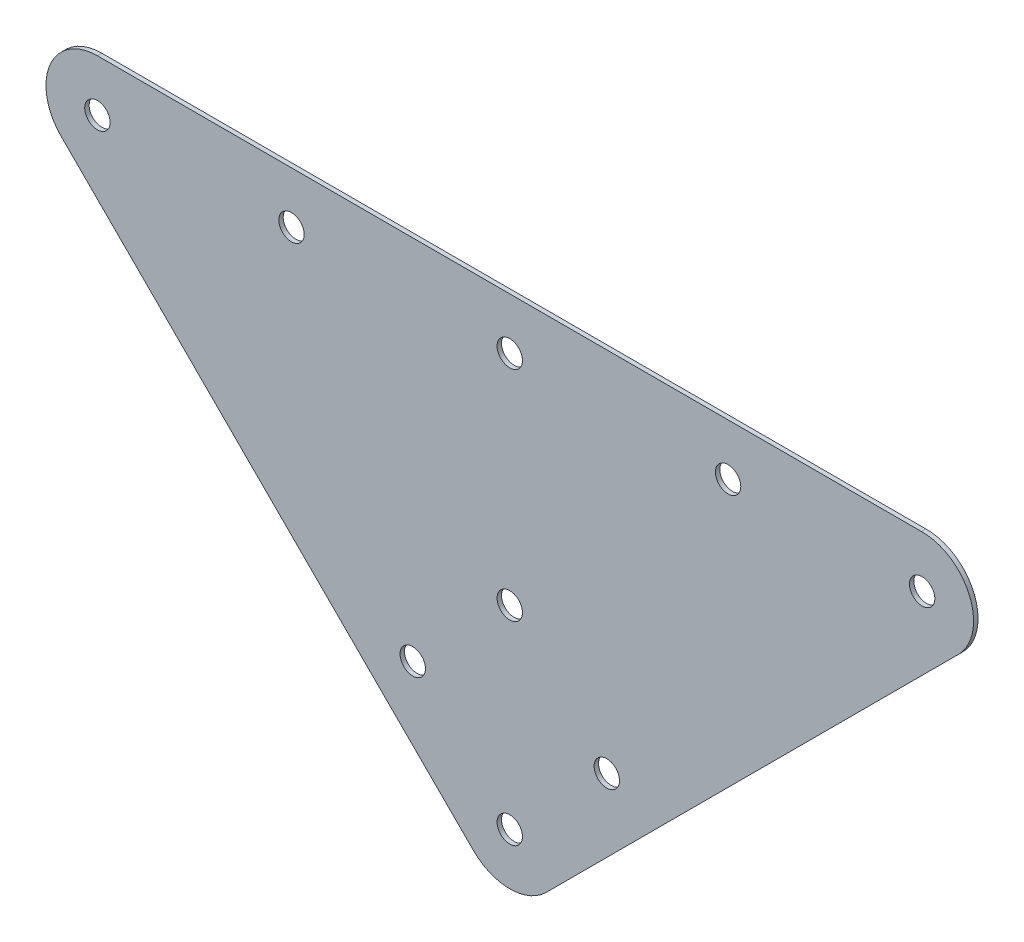
ISO-10303-21;
HEADER;
FILE_DESCRIPTION(('STEP AP214'),'2;1');
FILE_NAME('part.step','',(''),(''),'','','');
FILE_SCHEMA(('AUTOMOTIVE_DESIGN { 1 0 10303 214 1 1 1 1 }'));
ENDSEC;
DATA;
#1=APPLICATION_CONTEXT('core data for automotive mechanical design processes');
#2=APPLICATION_PROTOCOL_DEFINITION('international standard','automotive_design',2000,#1);
#3=PRODUCT_CONTEXT('',#1,'mechanical');
#4=PRODUCT('Part','Part','',(#3));
#5=PRODUCT_RELATED_PRODUCT_CATEGORY('part','',(#4));
#6=PRODUCT_DEFINITION_FORMATION('','',#4);
#7=PRODUCT_DEFINITION_CONTEXT('part definition',#1,'design');
#8=PRODUCT_DEFINITION('design','',#6,#7);
#9=PRODUCT_DEFINITION_SHAPE('','',#8);
#10=(LENGTH_UNIT() NAMED_UNIT(*) SI_UNIT(.MILLI.,.METRE.));
#11=(NAMED_UNIT(*) PLANE_ANGLE_UNIT() SI_UNIT($,.RADIAN.));
#12=(NAMED_UNIT(*) SI_UNIT($,.STERADIAN.) SOLID_ANGLE_UNIT());
#13=UNCERTAINTY_MEASURE_WITH_UNIT(LENGTH_MEASURE(1.E-05),#10,'distance_accuracy_value','');
#14=(GEOMETRIC_REPRESENTATION_CONTEXT(3) GLOBAL_UNCERTAINTY_ASSIGNED_CONTEXT((#13)) GLOBAL_UNIT_ASSIGNED_CONTEXT((#10,
#11,#12)) REPRESENTATION_CONTEXT('',''));
#15=CARTESIAN_POINT('',(0.,0.,0.));
#16=DIRECTION('',(0.,0.,1.));
#17=DIRECTION('',(1.,0.,0.));
#18=AXIS2_PLACEMENT_3D('',#15,#16,#17);
#19=CARTESIAN_POINT('',(-198.65512242099,-171.71435405727,1.6417931858));
#20=DIRECTION('',(0.,0.,1.));
#21=DIRECTION('',(1.,0.,0.));
#22=AXIS2_PLACEMENT_3D('',#19,#20,#21);
#23=PLANE('',#22);
#24=CARTESIAN_POINT('',(-198.65512242099,-99.8723050887162,1.6417931858));
#25=DIRECTION('',(0.,0.,1.));
#26=DIRECTION('',(1.,0.,0.));
#27=AXIS2_PLACEMENT_3D('',#24,#25,#26);
#28=CIRCLE('',#27,4.699);
#29=CARTESIAN_POINT('',(-193.95612242099,-99.8723050887162,1.6417931858));
#30=VERTEX_POINT('',#29);
#31=EDGE_CURVE('E402',#30,#30,#28,.T.);
#32=ORIENTED_EDGE('',*,*,#31,.F.);
#33=EDGE_LOOP('',(#32));
#34=FACE_BOUND('',#33,.T.);
#35=CARTESIAN_POINT('',(-198.65512242099,-171.71435405727,1.6417931858));
#36=DIRECTION('',(0.,0.,1.));
#37=DIRECTION('',(1.,0.,0.));
#38=AXIS2_PLACEMENT_3D('',#35,#36,#37);
#39=CIRCLE('',#38,4.699);
#40=CARTESIAN_POINT('',(-193.95612242099,-171.71435405727,1.6417931858));
#41=VERTEX_POINT('',#40);
#42=EDGE_CURVE('E414',#41,#41,#39,.T.);
#43=ORIENTED_EDGE('',*,*,#42,.F.);
#44=EDGE_LOOP('',(#43));
#45=FACE_BOUND('',#44,.T.);
#46=CARTESIAN_POINT('',(-279.47742751088,-19.05,1.6417931858));
#47=DIRECTION('',(0.,0.,1.));
#48=DIRECTION('',(1.,0.,0.));
#49=AXIS2_PLACEMENT_3D('',#46,#47,#48);
#50=CIRCLE('',#49,4.69900000000003);
#51=CARTESIAN_POINT('',(-274.77842751088,-19.05,1.6417931858));
#52=VERTEX_POINT('',#51);
#53=EDGE_CURVE('E426',#52,#52,#50,.T.);
#54=ORIENTED_EDGE('',*,*,#53,.F.);
#55=EDGE_LOOP('',(#54));
#56=FACE_BOUND('',#55,.T.);
#57=CARTESIAN_POINT('',(-117.83281721299,-19.05,1.6417931858));
#58=DIRECTION('',(0.,0.,1.));
#59=DIRECTION('',(1.,0.,0.));
#60=AXIS2_PLACEMENT_3D('',#57,#58,#59);
#61=CIRCLE('',#60,4.69899999999999);
#62=CARTESIAN_POINT('',(-113.13381721299,-19.05,1.6417931858));
#63=VERTEX_POINT('',#62);
#64=EDGE_CURVE('E438',#63,#63,#61,.T.);
#65=ORIENTED_EDGE('',*,*,#64,.F.);
#66=EDGE_LOOP('',(#65));
#67=FACE_BOUND('',#66,.T.);
#68=CARTESIAN_POINT('',(-198.65512242099,-171.71435405727,1.6417931858));
#69=DIRECTION('',(0.,0.,1.));
#70=DIRECTION('',(1.,0.,0.));
#71=AXIS2_PLACEMENT_3D('',#68,#69,#70);
#72=CIRCLE('',#71,19.0500000003624);
#73=CARTESIAN_POINT('',(-212.12550660285,-185.18473823913,1.6417931858));
#74=VERTEX_POINT('',#73);
#75=CARTESIAN_POINT('',(-185.18473823913,-185.18473823913,1.6417931858));
#76=VERTEX_POINT('',#75);
#77=EDGE_CURVE('E325',#74,#76,#72,.T.);
#78=ORIENTED_EDGE('',*,*,#77,.T.);
#79=DIRECTION('',(0.707106781186548,0.707106781186547,0.));
#80=VECTOR('',#79,1.);
#81=CARTESIAN_POINT('',(-185.18473823913,-185.18473823913,1.6417931858));
#82=LINE('',#81,#80);
#83=CARTESIAN_POINT('',(-32.7175007528533,-32.7175007528533,1.6417931858));
#84=VERTEX_POINT('',#83);
#85=EDGE_CURVE('E274',#76,#84,#82,.T.);
#86=ORIENTED_EDGE('',*,*,#85,.T.);
#87=CARTESIAN_POINT('',(-45.99076836499,-19.05,1.6417931858));
#88=DIRECTION('',(0.,0.,-1.));
#89=DIRECTION('',(-1.,0.,0.));
#90=AXIS2_PLACEMENT_3D('',#87,#88,#89);
#91=CIRCLE('',#90,19.0520395216009);
#92=CARTESIAN_POINT('',(-46.2695333782919,0.,1.6417931858));
#93=VERTEX_POINT('',#92);
#94=EDGE_CURVE('E292',#93,#84,#91,.T.);
#95=ORIENTED_EDGE('',*,*,#94,.F.);
#96=DIRECTION('',(-1.,0.,0.));
#97=VECTOR('',#96,1.);
#98=CARTESIAN_POINT('',(-46.2695333782919,0.,1.6417931858));
#99=LINE('',#98,#97);
#100=CARTESIAN_POINT('',(-351.31947646048,0.,1.6417931858));
#101=VERTEX_POINT('',#100);
#102=EDGE_CURVE('E285',#93,#101,#99,.T.);
#103=ORIENTED_EDGE('',*,*,#102,.T.);
#104=CARTESIAN_POINT('',(-351.319476478773,-19.05,1.6417931858));
#105=DIRECTION('',(0.,0.,-1.));
#106=DIRECTION('',(-1.,0.,0.));
#107=AXIS2_PLACEMENT_3D('',#104,#105,#106);
#108=CIRCLE('',#107,19.05);
#109=CARTESIAN_POINT('',(-364.78986065123,-32.5203841907501,1.6417931858));
#110=VERTEX_POINT('',#109);
#111=EDGE_CURVE('E290',#110,#101,#108,.T.);
#112=ORIENTED_EDGE('',*,*,#111,.F.);
#113=DIRECTION('',(-0.707106781186548,0.707106781186547,0.));
#114=VECTOR('',#113,1.);
#115=CARTESIAN_POINT('',(-212.12550660285,-185.18473823913,1.6417931858));
#116=LINE('',#115,#114);
#117=EDGE_CURVE('E305',#74,#110,#116,.T.);
#118=ORIENTED_EDGE('',*,*,#117,.F.);
#119=EDGE_LOOP('',(#78,#86,#95,#103,#112,#118));
#120=FACE_BOUND('',#119,.T.);
#121=CARTESIAN_POINT('',(-45.99076836499,-19.05,1.6417931858));
#122=DIRECTION('',(0.,0.,1.));
#123=DIRECTION('',(1.,0.,0.));
#124=AXIS2_PLACEMENT_3D('',#121,#122,#123);
#125=CIRCLE('',#124,4.699);
#126=CARTESIAN_POINT('',(-41.29176836499,-19.05,1.6417931858));
#127=VERTEX_POINT('',#126);
#128=EDGE_CURVE('E313',#127,#127,#125,.T.);
#129=ORIENTED_EDGE('',*,*,#128,.F.);
#130=EDGE_LOOP('',(#129));
#131=FACE_BOUND('',#130,.T.);
#132=CARTESIAN_POINT('',(-198.65512242099,-19.05,1.6417931858));
#133=DIRECTION('',(0.,0.,1.));
#134=DIRECTION('',(1.,0.,0.));
#135=AXIS2_PLACEMENT_3D('',#132,#133,#134);
#136=CIRCLE('',#135,4.699);
#137=CARTESIAN_POINT('',(-193.95612242099,-19.05,1.6417931858));
#138=VERTEX_POINT('',#137);
#139=EDGE_CURVE('E432',#138,#138,#136,.T.);
#140=ORIENTED_EDGE('',*,*,#139,.F.);
#141=EDGE_LOOP('',(#140));
#142=FACE_BOUND('',#141,.T.);
#143=CARTESIAN_POINT('',(-162.734097936713,-135.793329572993,1.6417931858));
#144=DIRECTION('',(0.,0.,1.));
#145=DIRECTION('',(1.,0.,0.));
#146=AXIS2_PLACEMENT_3D('',#143,#144,#145);
#147=CIRCLE('',#146,4.699);
#148=CARTESIAN_POINT('',(-158.035097936713,-135.793329572993,1.6417931858));
#149=VERTEX_POINT('',#148);
#150=EDGE_CURVE('E420',#149,#149,#147,.T.);
#151=ORIENTED_EDGE('',*,*,#150,.F.);
#152=EDGE_LOOP('',(#151));
#153=FACE_BOUND('',#152,.T.);
#154=CARTESIAN_POINT('',(-234.576146905524,-135.79332957325,1.6417931858));
#155=DIRECTION('',(0.,0.,1.));
#156=DIRECTION('',(1.,0.,0.));
#157=AXIS2_PLACEMENT_3D('',#154,#155,#156);
#158=CIRCLE('',#157,4.69900000000024);
#159=CARTESIAN_POINT('',(-229.877146905524,-135.79332957325,1.6417931858));
#160=VERTEX_POINT('',#159);
#161=EDGE_CURVE('E408',#160,#160,#158,.T.);
#162=ORIENTED_EDGE('',*,*,#161,.F.);
#163=EDGE_LOOP('',(#162));
#164=FACE_BOUND('',#163,.T.);
#165=CARTESIAN_POINT('',(-351.319476478773,-19.05,1.6417931858));
#166=DIRECTION('',(0.,0.,1.));
#167=DIRECTION('',(1.,0.,0.));
#168=AXIS2_PLACEMENT_3D('',#165,#166,#167);
#169=CIRCLE('',#168,4.69900000000009);
#170=CARTESIAN_POINT('',(-346.620476478773,-19.05,1.6417931858));
#171=VERTEX_POINT('',#170);
#172=EDGE_CURVE('E393',#171,#171,#169,.T.);
#173=ORIENTED_EDGE('',*,*,#172,.F.);
#174=EDGE_LOOP('',(#173));
#175=FACE_BOUND('',#174,.T.);
#176=ADVANCED_FACE('F225',(#34,#45,#56,#67,#120,#131,#142,#153,#164,#175),#23,.T.);
#177=CARTESIAN_POINT('',(-198.65512242099,-171.71435405727,0.));
#178=DIRECTION('',(0.,0.,1.));
#179=DIRECTION('',(1.,0.,0.));
#180=AXIS2_PLACEMENT_3D('',#177,#178,#179);
#181=PLANE('',#180);
#182=CARTESIAN_POINT('',(-198.65512242099,-171.71435405727,0.));
#183=DIRECTION('',(0.,0.,1.));
#184=DIRECTION('',(1.,0.,0.));
#185=AXIS2_PLACEMENT_3D('',#182,#183,#184);
#186=CIRCLE('',#185,19.0500000003624);
#187=CARTESIAN_POINT('',(-212.12550660285,-185.18473823913,0.));
#188=VERTEX_POINT('',#187);
#189=CARTESIAN_POINT('',(-185.18473823913,-185.18473823913,0.));
#190=VERTEX_POINT('',#189);
#191=EDGE_CURVE('E310',#188,#190,#186,.T.);
#192=ORIENTED_EDGE('',*,*,#191,.F.);
#193=DIRECTION('',(-0.707106781186548,0.707106781186547,0.));
#194=VECTOR('',#193,1.);
#195=CARTESIAN_POINT('',(-212.12550660285,-185.18473823913,0.));
#196=LINE('',#195,#194);
#197=CARTESIAN_POINT('',(-364.78986065123,-32.5203841907501,0.));
#198=VERTEX_POINT('',#197);
#199=EDGE_CURVE('E322',#188,#198,#196,.T.);
#200=ORIENTED_EDGE('',*,*,#199,.T.);
#201=CARTESIAN_POINT('',(-351.319476478773,-19.05,0.));
#202=DIRECTION('',(0.,0.,-1.));
#203=DIRECTION('',(-1.,0.,0.));
#204=AXIS2_PLACEMENT_3D('',#201,#202,#203);
#205=CIRCLE('',#204,19.05);
#206=CARTESIAN_POINT('',(-351.31947646048,0.,0.));
#207=VERTEX_POINT('',#206);
#208=EDGE_CURVE('E320',#198,#207,#205,.T.);
#209=ORIENTED_EDGE('',*,*,#208,.T.);
#210=DIRECTION('',(-1.,0.,0.));
#211=VECTOR('',#210,1.);
#212=CARTESIAN_POINT('',(-46.2695333782919,0.,0.));
#213=LINE('',#212,#211);
#214=CARTESIAN_POINT('',(-46.2695333782919,0.,0.));
#215=VERTEX_POINT('',#214);
#216=EDGE_CURVE('E299',#215,#207,#213,.T.);
#217=ORIENTED_EDGE('',*,*,#216,.F.);
#218=CARTESIAN_POINT('',(-45.99076836499,-19.05,0.));
#219=DIRECTION('',(0.,0.,-1.));
#220=DIRECTION('',(-1.,0.,0.));
#221=AXIS2_PLACEMENT_3D('',#218,#219,#220);
#222=CIRCLE('',#221,19.0520395216009);
#223=CARTESIAN_POINT('',(-32.7175007528533,-32.7175007528533,0.));
#224=VERTEX_POINT('',#223);
#225=EDGE_CURVE('E316',#215,#224,#222,.T.);
#226=ORIENTED_EDGE('',*,*,#225,.T.);
#227=DIRECTION('',(0.707106781186548,0.707106781186547,0.));
#228=VECTOR('',#227,1.);
#229=CARTESIAN_POINT('',(-185.18473823913,-185.18473823913,0.));
#230=LINE('',#229,#228);
#231=EDGE_CURVE('E312',#190,#224,#230,.T.);
#232=ORIENTED_EDGE('',*,*,#231,.F.);
#233=EDGE_LOOP('',(#192,#200,#209,#217,#226,#232));
#234=FACE_BOUND('',#233,.T.);
#235=CARTESIAN_POINT('',(-45.99076836499,-19.05,0.));
#236=DIRECTION('',(0.,0.,1.));
#237=DIRECTION('',(1.,0.,0.));
#238=AXIS2_PLACEMENT_3D('',#235,#236,#237);
#239=CIRCLE('',#238,4.699);
#240=CARTESIAN_POINT('',(-41.29176836499,-19.05,0.));
#241=VERTEX_POINT('',#240);
#242=EDGE_CURVE('E441',#241,#241,#239,.T.);
#243=ORIENTED_EDGE('',*,*,#242,.T.);
#244=EDGE_LOOP('',(#243));
#245=FACE_BOUND('',#244,.T.);
#246=CARTESIAN_POINT('',(-117.83281721299,-19.05,0.));
#247=DIRECTION('',(0.,0.,1.));
#248=DIRECTION('',(1.,0.,0.));
#249=AXIS2_PLACEMENT_3D('',#246,#247,#248);
#250=CIRCLE('',#249,4.69899999999999);
#251=CARTESIAN_POINT('',(-113.13381721299,-19.05,0.));
#252=VERTEX_POINT('',#251);
#253=EDGE_CURVE('E435',#252,#252,#250,.T.);
#254=ORIENTED_EDGE('',*,*,#253,.T.);
#255=EDGE_LOOP('',(#254));
#256=FACE_BOUND('',#255,.T.);
#257=CARTESIAN_POINT('',(-198.65512242099,-19.05,0.));
#258=DIRECTION('',(0.,0.,1.));
#259=DIRECTION('',(1.,0.,0.));
#260=AXIS2_PLACEMENT_3D('',#257,#258,#259);
#261=CIRCLE('',#260,4.699);
#262=CARTESIAN_POINT('',(-193.95612242099,-19.05,0.));
#263=VERTEX_POINT('',#262);
#264=EDGE_CURVE('E429',#263,#263,#261,.T.);
#265=ORIENTED_EDGE('',*,*,#264,.T.);
#266=EDGE_LOOP('',(#265));
#267=FACE_BOUND('',#266,.T.);
#268=CARTESIAN_POINT('',(-279.47742751088,-19.05,0.));
#269=DIRECTION('',(0.,0.,1.));
#270=DIRECTION('',(1.,0.,0.));
#271=AXIS2_PLACEMENT_3D('',#268,#269,#270);
#272=CIRCLE('',#271,4.69900000000003);
#273=CARTESIAN_POINT('',(-274.77842751088,-19.05,0.));
#274=VERTEX_POINT('',#273);
#275=EDGE_CURVE('E423',#274,#274,#272,.T.);
#276=ORIENTED_EDGE('',*,*,#275,.T.);
#277=EDGE_LOOP('',(#276));
#278=FACE_BOUND('',#277,.T.);
#279=CARTESIAN_POINT('',(-162.734097936713,-135.793329572993,0.));
#280=DIRECTION('',(0.,0.,1.));
#281=DIRECTION('',(1.,0.,0.));
#282=AXIS2_PLACEMENT_3D('',#279,#280,#281);
#283=CIRCLE('',#282,4.699);
#284=CARTESIAN_POINT('',(-158.035097936713,-135.793329572993,0.));
#285=VERTEX_POINT('',#284);
#286=EDGE_CURVE('E417',#285,#285,#283,.T.);
#287=ORIENTED_EDGE('',*,*,#286,.T.);
#288=EDGE_LOOP('',(#287));
#289=FACE_BOUND('',#288,.T.);
#290=CARTESIAN_POINT('',(-198.65512242099,-171.71435405727,0.));
#291=DIRECTION('',(0.,0.,1.));
#292=DIRECTION('',(1.,0.,0.));
#293=AXIS2_PLACEMENT_3D('',#290,#291,#292);
#294=CIRCLE('',#293,4.699);
#295=CARTESIAN_POINT('',(-193.95612242099,-171.71435405727,0.));
#296=VERTEX_POINT('',#295);
#297=EDGE_CURVE('E411',#296,#296,#294,.T.);
#298=ORIENTED_EDGE('',*,*,#297,.T.);
#299=EDGE_LOOP('',(#298));
#300=FACE_BOUND('',#299,.T.);
#301=CARTESIAN_POINT('',(-234.576146905524,-135.79332957325,0.));
#302=DIRECTION('',(0.,0.,1.));
#303=DIRECTION('',(1.,0.,0.));
#304=AXIS2_PLACEMENT_3D('',#301,#302,#303);
#305=CIRCLE('',#304,4.69900000000024);
#306=CARTESIAN_POINT('',(-229.877146905524,-135.79332957325,0.));
#307=VERTEX_POINT('',#306);
#308=EDGE_CURVE('E405',#307,#307,#305,.T.);
#309=ORIENTED_EDGE('',*,*,#308,.T.);
#310=EDGE_LOOP('',(#309));
#311=FACE_BOUND('',#310,.T.);
#312=CARTESIAN_POINT('',(-198.65512242099,-99.8723050887162,0.));
#313=DIRECTION('',(0.,0.,1.));
#314=DIRECTION('',(1.,0.,0.));
#315=AXIS2_PLACEMENT_3D('',#312,#313,#314);
#316=CIRCLE('',#315,4.699);
#317=CARTESIAN_POINT('',(-193.95612242099,-99.8723050887162,0.));
#318=VERTEX_POINT('',#317);
#319=EDGE_CURVE('E399',#318,#318,#316,.T.);
#320=ORIENTED_EDGE('',*,*,#319,.T.);
#321=EDGE_LOOP('',(#320));
#322=FACE_BOUND('',#321,.T.);
#323=CARTESIAN_POINT('',(-351.319476478773,-19.05,0.));
#324=DIRECTION('',(0.,0.,1.));
#325=DIRECTION('',(1.,0.,0.));
#326=AXIS2_PLACEMENT_3D('',#323,#324,#325);
#327=CIRCLE('',#326,4.69900000000009);
#328=CARTESIAN_POINT('',(-346.620476478773,-19.05,0.));
#329=VERTEX_POINT('',#328);
#330=EDGE_CURVE('E396',#329,#329,#327,.T.);
#331=ORIENTED_EDGE('',*,*,#330,.T.);
#332=EDGE_LOOP('',(#331));
#333=FACE_BOUND('',#332,.T.);
#334=ADVANCED_FACE('F334',(#234,#245,#256,#267,#278,#289,#300,#311,#322,#333),#181,.F.);
#335=CARTESIAN_POINT('',(-198.65512242099,-171.71435405727,1.6417931858));
#336=DIRECTION('',(0.,0.,-1.));
#337=DIRECTION('',(-1.,0.,0.));
#338=AXIS2_PLACEMENT_3D('',#335,#336,#337);
#339=CYLINDRICAL_SURFACE('',#338,19.0500000003624);
#340=ORIENTED_EDGE('',*,*,#191,.T.);
#341=DIRECTION('',(0.,0.,-1.));
#342=VECTOR('',#341,1.);
#343=CARTESIAN_POINT('',(-185.18473823913,-185.18473823913,1.6417931858));
#344=LINE('',#343,#342);
#345=EDGE_CURVE('E12',#76,#190,#344,.T.);
#346=ORIENTED_EDGE('',*,*,#345,.F.);
#347=ORIENTED_EDGE('',*,*,#77,.F.);
#348=DIRECTION('',(0.,0.,-1.));
#349=VECTOR('',#348,1.);
#350=CARTESIAN_POINT('',(-212.12550660285,-185.18473823913,1.6417931858));
#351=LINE('',#350,#349);
#352=EDGE_CURVE('E242',#74,#188,#351,.T.);
#353=ORIENTED_EDGE('',*,*,#352,.T.);
#354=EDGE_LOOP('',(#340,#346,#347,#353));
#355=FACE_BOUND('',#354,.T.);
#356=ADVANCED_FACE('F227',(#355),#339,.T.);
#357=CARTESIAN_POINT('',(-185.18473823913,-185.18473823913,1.6417931858));
#358=DIRECTION('',(-0.707106781186547,0.707106781186548,0.));
#359=DIRECTION('',(-0.707106781186548,-0.707106781186547,0.));
#360=AXIS2_PLACEMENT_3D('',#357,#358,#359);
#361=PLANE('',#360);
#362=ORIENTED_EDGE('',*,*,#231,.T.);
#363=DIRECTION('',(0.,0.,-1.));
#364=VECTOR('',#363,1.);
#365=CARTESIAN_POINT('',(-32.7175007528533,-32.7175007528533,1.6417931858));
#366=LINE('',#365,#364);
#367=EDGE_CURVE('E234',#84,#224,#366,.T.);
#368=ORIENTED_EDGE('',*,*,#367,.F.);
#369=ORIENTED_EDGE('',*,*,#85,.F.);
#370=ORIENTED_EDGE('',*,*,#345,.T.);
#371=EDGE_LOOP('',(#362,#368,#369,#370));
#372=FACE_BOUND('',#371,.T.);
#373=ADVANCED_FACE('F331',(#372),#361,.F.);
#374=CARTESIAN_POINT('',(-45.99076836499,-19.05,1.6417931858));
#375=DIRECTION('',(0.,0.,-1.));
#376=DIRECTION('',(-1.,0.,0.));
#377=AXIS2_PLACEMENT_3D('',#374,#375,#376);
#378=CYLINDRICAL_SURFACE('',#377,19.0520395216009);
#379=ORIENTED_EDGE('',*,*,#225,.F.);
#380=DIRECTION('',(0.,0.,-1.));
#381=VECTOR('',#380,1.);
#382=CARTESIAN_POINT('',(-46.2695333782919,0.,1.6417931858));
#383=LINE('',#382,#381);
#384=EDGE_CURVE('E302',#93,#215,#383,.T.);
#385=ORIENTED_EDGE('',*,*,#384,.F.);
#386=ORIENTED_EDGE('',*,*,#94,.T.);
#387=ORIENTED_EDGE('',*,*,#367,.T.);
#388=EDGE_LOOP('',(#379,#385,#386,#387));
#389=FACE_BOUND('',#388,.T.);
#390=ADVANCED_FACE('F330',(#389),#378,.T.);
#391=CARTESIAN_POINT('',(-46.2695333782919,0.,1.6417931858));
#392=DIRECTION('',(0.,-1.,0.));
#393=DIRECTION('',(1.,0.,0.));
#394=AXIS2_PLACEMENT_3D('',#391,#392,#393);
#395=PLANE('',#394);
#396=ORIENTED_EDGE('',*,*,#216,.T.);
#397=DIRECTION('',(0.,0.,-1.));
#398=VECTOR('',#397,1.);
#399=CARTESIAN_POINT('',(-351.31947646048,0.,1.6417931858));
#400=LINE('',#399,#398);
#401=EDGE_CURVE('E296',#101,#207,#400,.T.);
#402=ORIENTED_EDGE('',*,*,#401,.F.);
#403=ORIENTED_EDGE('',*,*,#102,.F.);
#404=ORIENTED_EDGE('',*,*,#384,.T.);
#405=EDGE_LOOP('',(#396,#402,#403,#404));
#406=FACE_BOUND('',#405,.T.);
#407=ADVANCED_FACE('F297',(#406),#395,.F.);
#408=CARTESIAN_POINT('',(-351.319476478773,-19.05,1.6417931858));
#409=DIRECTION('',(0.,0.,-1.));
#410=DIRECTION('',(-1.,0.,0.));
#411=AXIS2_PLACEMENT_3D('',#408,#409,#410);
#412=CYLINDRICAL_SURFACE('',#411,19.05);
#413=ORIENTED_EDGE('',*,*,#208,.F.);
#414=DIRECTION('',(0.,0.,-1.));
#415=VECTOR('',#414,1.);
#416=CARTESIAN_POINT('',(-364.78986065123,-32.5203841907501,1.6417931858));
#417=LINE('',#416,#415);
#418=EDGE_CURVE('E262',#110,#198,#417,.T.);
#419=ORIENTED_EDGE('',*,*,#418,.F.);
#420=ORIENTED_EDGE('',*,*,#111,.T.);
#421=ORIENTED_EDGE('',*,*,#401,.T.);
#422=EDGE_LOOP('',(#413,#419,#420,#421));
#423=FACE_BOUND('',#422,.T.);
#424=ADVANCED_FACE('F304',(#423),#412,.T.);
#425=CARTESIAN_POINT('',(-212.12550660285,-185.18473823913,1.6417931858));
#426=DIRECTION('',(-0.707106781186547,-0.707106781186548,0.));
#427=DIRECTION('',(0.707106781186548,-0.707106781186547,0.));
#428=AXIS2_PLACEMENT_3D('',#425,#426,#427);
#429=PLANE('',#428);
#430=ORIENTED_EDGE('',*,*,#199,.F.);
#431=ORIENTED_EDGE('',*,*,#352,.F.);
#432=ORIENTED_EDGE('',*,*,#117,.T.);
#433=ORIENTED_EDGE('',*,*,#418,.T.);
#434=EDGE_LOOP('',(#430,#431,#432,#433));
#435=FACE_BOUND('',#434,.T.);
#436=ADVANCED_FACE('F336',(#435),#429,.T.);
#437=CARTESIAN_POINT('',(-45.99076836499,-19.05,1.6417931858));
#438=DIRECTION('',(0.,0.,-1.));
#439=DIRECTION('',(-1.,0.,0.));
#440=AXIS2_PLACEMENT_3D('',#437,#438,#439);
#441=CYLINDRICAL_SURFACE('',#440,4.699);
#442=ORIENTED_EDGE('',*,*,#128,.T.);
#443=EDGE_LOOP('',(#442));
#444=FACE_BOUND('',#443,.T.);
#445=ORIENTED_EDGE('',*,*,#242,.F.);
#446=EDGE_LOOP('',(#445));
#447=FACE_BOUND('',#446,.T.);
#448=ADVANCED_FACE('F338',(#444,#447),#441,.F.);
#449=CARTESIAN_POINT('',(-117.83281721299,-19.05,1.6417931858));
#450=DIRECTION('',(0.,0.,-1.));
#451=DIRECTION('',(-1.,0.,0.));
#452=AXIS2_PLACEMENT_3D('',#449,#450,#451);
#453=CYLINDRICAL_SURFACE('',#452,4.69899999999999);
#454=ORIENTED_EDGE('',*,*,#64,.T.);
#455=EDGE_LOOP('',(#454));
#456=FACE_BOUND('',#455,.T.);
#457=ORIENTED_EDGE('',*,*,#253,.F.);
#458=EDGE_LOOP('',(#457));
#459=FACE_BOUND('',#458,.T.);
#460=ADVANCED_FACE('F344',(#456,#459),#453,.F.);
#461=CARTESIAN_POINT('',(-198.65512242099,-19.05,1.6417931858));
#462=DIRECTION('',(0.,0.,-1.));
#463=DIRECTION('',(-1.,0.,0.));
#464=AXIS2_PLACEMENT_3D('',#461,#462,#463);
#465=CYLINDRICAL_SURFACE('',#464,4.699);
#466=ORIENTED_EDGE('',*,*,#139,.T.);
#467=EDGE_LOOP('',(#466));
#468=FACE_BOUND('',#467,.T.);
#469=ORIENTED_EDGE('',*,*,#264,.F.);
#470=EDGE_LOOP('',(#469));
#471=FACE_BOUND('',#470,.T.);
#472=ADVANCED_FACE('F360',(#468,#471),#465,.F.);
#473=CARTESIAN_POINT('',(-279.47742751088,-19.05,1.6417931858));
#474=DIRECTION('',(0.,0.,-1.));
#475=DIRECTION('',(-1.,0.,0.));
#476=AXIS2_PLACEMENT_3D('',#473,#474,#475);
#477=CYLINDRICAL_SURFACE('',#476,4.69900000000003);
#478=ORIENTED_EDGE('',*,*,#53,.T.);
#479=EDGE_LOOP('',(#478));
#480=FACE_BOUND('',#479,.T.);
#481=ORIENTED_EDGE('',*,*,#275,.F.);
#482=EDGE_LOOP('',(#481));
#483=FACE_BOUND('',#482,.T.);
#484=ADVANCED_FACE('F364',(#480,#483),#477,.F.);
#485=CARTESIAN_POINT('',(-162.734097936713,-135.793329572993,1.6417931858));
#486=DIRECTION('',(0.,0.,-1.));
#487=DIRECTION('',(-1.,0.,0.));
#488=AXIS2_PLACEMENT_3D('',#485,#486,#487);
#489=CYLINDRICAL_SURFACE('',#488,4.699);
#490=ORIENTED_EDGE('',*,*,#150,.T.);
#491=EDGE_LOOP('',(#490));
#492=FACE_BOUND('',#491,.T.);
#493=ORIENTED_EDGE('',*,*,#286,.F.);
#494=EDGE_LOOP('',(#493));
#495=FACE_BOUND('',#494,.T.);
#496=ADVANCED_FACE('F368',(#492,#495),#489,.F.);
#497=CARTESIAN_POINT('',(-198.65512242099,-171.71435405727,1.6417931858));
#498=DIRECTION('',(0.,0.,-1.));
#499=DIRECTION('',(-1.,0.,0.));
#500=AXIS2_PLACEMENT_3D('',#497,#498,#499);
#501=CYLINDRICAL_SURFACE('',#500,4.699);
#502=ORIENTED_EDGE('',*,*,#42,.T.);
#503=EDGE_LOOP('',(#502));
#504=FACE_BOUND('',#503,.T.);
#505=ORIENTED_EDGE('',*,*,#297,.F.);
#506=EDGE_LOOP('',(#505));
#507=FACE_BOUND('',#506,.T.);
#508=ADVANCED_FACE('F372',(#504,#507),#501,.F.);
#509=CARTESIAN_POINT('',(-234.576146905524,-135.79332957325,1.6417931858));
#510=DIRECTION('',(0.,0.,-1.));
#511=DIRECTION('',(-1.,0.,0.));
#512=AXIS2_PLACEMENT_3D('',#509,#510,#511);
#513=CYLINDRICAL_SURFACE('',#512,4.69900000000024);
#514=ORIENTED_EDGE('',*,*,#161,.T.);
#515=EDGE_LOOP('',(#514));
#516=FACE_BOUND('',#515,.T.);
#517=ORIENTED_EDGE('',*,*,#308,.F.);
#518=EDGE_LOOP('',(#517));
#519=FACE_BOUND('',#518,.T.);
#520=ADVANCED_FACE('F376',(#516,#519),#513,.F.);
#521=CARTESIAN_POINT('',(-198.65512242099,-99.8723050887162,1.6417931858));
#522=DIRECTION('',(0.,0.,-1.));
#523=DIRECTION('',(-1.,0.,0.));
#524=AXIS2_PLACEMENT_3D('',#521,#522,#523);
#525=CYLINDRICAL_SURFACE('',#524,4.699);
#526=ORIENTED_EDGE('',*,*,#31,.T.);
#527=EDGE_LOOP('',(#526));
#528=FACE_BOUND('',#527,.T.);
#529=ORIENTED_EDGE('',*,*,#319,.F.);
#530=EDGE_LOOP('',(#529));
#531=FACE_BOUND('',#530,.T.);
#532=ADVANCED_FACE('F380',(#528,#531),#525,.F.);
#533=CARTESIAN_POINT('',(-351.319476478773,-19.05,1.6417931858));
#534=DIRECTION('',(0.,0.,-1.));
#535=DIRECTION('',(-1.,0.,0.));
#536=AXIS2_PLACEMENT_3D('',#533,#534,#535);
#537=CYLINDRICAL_SURFACE('',#536,4.69900000000009);
#538=ORIENTED_EDGE('',*,*,#172,.T.);
#539=EDGE_LOOP('',(#538));
#540=FACE_BOUND('',#539,.T.);
#541=ORIENTED_EDGE('',*,*,#330,.F.);
#542=EDGE_LOOP('',(#541));
#543=FACE_BOUND('',#542,.T.);
#544=ADVANCED_FACE('F384',(#540,#543),#537,.F.);
#545=CLOSED_SHELL('',(#176,#334,#356,#373,#390,#407,#424,#436,#448,#460,#472,#484,#496,#508,
#520,#532,#544));
#546=MANIFOLD_SOLID_BREP('B2',#545);
#547=ADVANCED_BREP_SHAPE_REPRESENTATION('',(#18,#546),#14);
#548=SHAPE_DEFINITION_REPRESENTATION(#9,#547);
ENDSEC;
END-ISO-10303-21;
